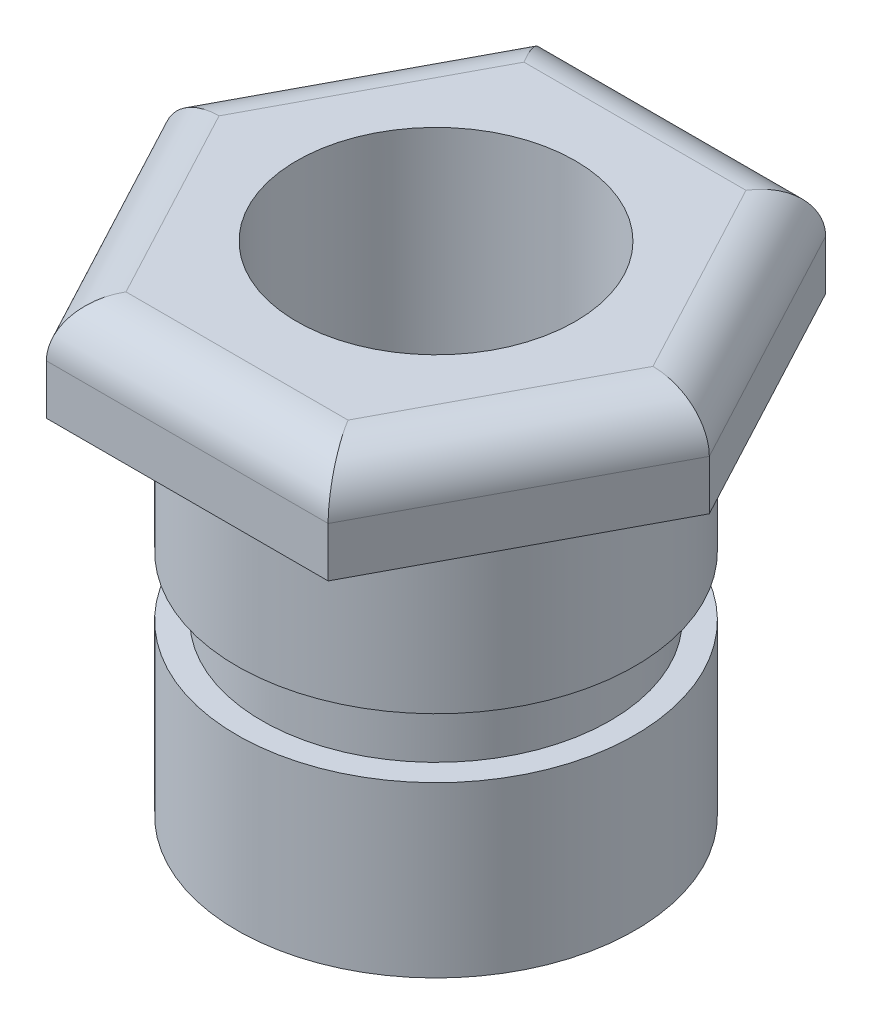
ISO-10303-21;
HEADER;
FILE_DESCRIPTION(('STEP AP214'),'2;1');
FILE_NAME('part.step','',(''),(''),'','','');
FILE_SCHEMA(('AUTOMOTIVE_DESIGN { 1 0 10303 214 1 1 1 1 }'));
ENDSEC;
DATA;
#1=APPLICATION_CONTEXT('core data for automotive mechanical design processes');
#2=APPLICATION_PROTOCOL_DEFINITION('international standard','automotive_design',2000,#1);
#3=PRODUCT_CONTEXT('',#1,'mechanical');
#4=PRODUCT('Part','Part','',(#3));
#5=PRODUCT_RELATED_PRODUCT_CATEGORY('part','',(#4));
#6=PRODUCT_DEFINITION_FORMATION('','',#4);
#7=PRODUCT_DEFINITION_CONTEXT('part definition',#1,'design');
#8=PRODUCT_DEFINITION('design','',#6,#7);
#9=PRODUCT_DEFINITION_SHAPE('','',#8);
#10=(LENGTH_UNIT() NAMED_UNIT(*) SI_UNIT(.MILLI.,.METRE.));
#11=(NAMED_UNIT(*) PLANE_ANGLE_UNIT() SI_UNIT($,.RADIAN.));
#12=(NAMED_UNIT(*) SI_UNIT($,.STERADIAN.) SOLID_ANGLE_UNIT());
#13=UNCERTAINTY_MEASURE_WITH_UNIT(LENGTH_MEASURE(1.E-05),#10,'distance_accuracy_value','');
#14=(GEOMETRIC_REPRESENTATION_CONTEXT(3) GLOBAL_UNCERTAINTY_ASSIGNED_CONTEXT((#13)) GLOBAL_UNIT_ASSIGNED_CONTEXT((#10,
#11,#12)) REPRESENTATION_CONTEXT('',''));
#15=CARTESIAN_POINT('',(0.,0.,0.));
#16=DIRECTION('',(0.,0.,1.));
#17=DIRECTION('',(1.,0.,0.));
#18=AXIS2_PLACEMENT_3D('',#15,#16,#17);
#19=CARTESIAN_POINT('',(0.,0.,0.));
#20=DIRECTION('',(0.,1.,0.));
#21=DIRECTION('',(-1.,0.,0.));
#22=AXIS2_PLACEMENT_3D('',#19,#20,#21);
#23=PLANE('',#22);
#24=CARTESIAN_POINT('',(0.,0.,0.));
#25=DIRECTION('',(0.,-1.,0.));
#26=DIRECTION('',(1.,0.,0.));
#27=AXIS2_PLACEMENT_3D('',#24,#25,#26);
#28=CIRCLE('',#27,28.);
#29=CARTESIAN_POINT('',(28.,0.,0.));
#30=VERTEX_POINT('',#29);
#31=EDGE_CURVE('E437',#30,#30,#28,.T.);
#32=ORIENTED_EDGE('',*,*,#31,.F.);
#33=EDGE_LOOP('',(#32));
#34=FACE_BOUND('',#33,.T.);
#35=CARTESIAN_POINT('',(0.,0.,0.));
#36=DIRECTION('',(0.,1.,0.));
#37=DIRECTION('',(-1.,0.,0.));
#38=AXIS2_PLACEMENT_3D('',#35,#36,#37);
#39=CIRCLE('',#38,40.);
#40=CARTESIAN_POINT('',(-40.,0.,0.));
#41=VERTEX_POINT('',#40);
#42=EDGE_CURVE('E163',#41,#41,#39,.T.);
#43=ORIENTED_EDGE('',*,*,#42,.F.);
#44=EDGE_LOOP('',(#43));
#45=FACE_BOUND('',#44,.T.);
#46=ADVANCED_FACE('F35',(#34,#45),#23,.F.);
#47=CARTESIAN_POINT('',(0.,103.412132622253,0.));
#48=DIRECTION('',(0.,1.,0.));
#49=DIRECTION('',(-1.,0.,0.));
#50=AXIS2_PLACEMENT_3D('',#47,#48,#49);
#51=CYLINDRICAL_SURFACE('',#50,40.);
#52=CARTESIAN_POINT('',(0.,34.,0.));
#53=DIRECTION('',(0.,1.,0.));
#54=DIRECTION('',(-1.,0.,0.));
#55=AXIS2_PLACEMENT_3D('',#52,#53,#54);
#56=CIRCLE('',#55,40.);
#57=CARTESIAN_POINT('',(-40.,34.,0.));
#58=VERTEX_POINT('',#57);
#59=EDGE_CURVE('E160',#58,#58,#56,.T.);
#60=ORIENTED_EDGE('',*,*,#59,.F.);
#61=EDGE_LOOP('',(#60));
#62=FACE_BOUND('',#61,.T.);
#63=ORIENTED_EDGE('',*,*,#42,.T.);
#64=EDGE_LOOP('',(#63));
#65=FACE_BOUND('',#64,.T.);
#66=ADVANCED_FACE('F241',(#62,#65),#51,.T.);
#67=CARTESIAN_POINT('',(40.,34.,0.));
#68=DIRECTION('',(0.,-1.,0.));
#69=DIRECTION('',(1.,0.,0.));
#70=AXIS2_PLACEMENT_3D('',#67,#68,#69);
#71=PLANE('',#70);
#72=CARTESIAN_POINT('',(0.,34.,0.));
#73=DIRECTION('',(0.,1.,0.));
#74=DIRECTION('',(-1.,0.,0.));
#75=AXIS2_PLACEMENT_3D('',#72,#73,#74);
#76=CIRCLE('',#75,35.);
#77=CARTESIAN_POINT('',(-35.,34.,0.));
#78=VERTEX_POINT('',#77);
#79=EDGE_CURVE('E157',#78,#78,#76,.T.);
#80=ORIENTED_EDGE('',*,*,#79,.F.);
#81=EDGE_LOOP('',(#80));
#82=FACE_BOUND('',#81,.T.);
#83=ORIENTED_EDGE('',*,*,#59,.T.);
#84=EDGE_LOOP('',(#83));
#85=FACE_BOUND('',#84,.T.);
#86=ADVANCED_FACE('F247',(#82,#85),#71,.F.);
#87=CARTESIAN_POINT('',(0.,103.412132622253,0.));
#88=DIRECTION('',(0.,1.,0.));
#89=DIRECTION('',(-1.,0.,0.));
#90=AXIS2_PLACEMENT_3D('',#87,#88,#89);
#91=CYLINDRICAL_SURFACE('',#90,35.);
#92=CARTESIAN_POINT('',(0.,46.,0.));
#93=DIRECTION('',(0.,1.,0.));
#94=DIRECTION('',(-1.,0.,0.));
#95=AXIS2_PLACEMENT_3D('',#92,#93,#94);
#96=CIRCLE('',#95,35.);
#97=CARTESIAN_POINT('',(-35.,46.,0.));
#98=VERTEX_POINT('',#97);
#99=EDGE_CURVE('E154',#98,#98,#96,.T.);
#100=ORIENTED_EDGE('',*,*,#99,.F.);
#101=EDGE_LOOP('',(#100));
#102=FACE_BOUND('',#101,.T.);
#103=ORIENTED_EDGE('',*,*,#79,.T.);
#104=EDGE_LOOP('',(#103));
#105=FACE_BOUND('',#104,.T.);
#106=ADVANCED_FACE('F312',(#102,#105),#91,.T.);
#107=CARTESIAN_POINT('',(35.,46.,0.));
#108=DIRECTION('',(0.,1.,0.));
#109=DIRECTION('',(-1.,0.,0.));
#110=AXIS2_PLACEMENT_3D('',#107,#108,#109);
#111=PLANE('',#110);
#112=CARTESIAN_POINT('',(0.,46.,0.));
#113=DIRECTION('',(0.,1.,0.));
#114=DIRECTION('',(-1.,0.,0.));
#115=AXIS2_PLACEMENT_3D('',#112,#113,#114);
#116=CIRCLE('',#115,40.);
#117=CARTESIAN_POINT('',(-40.,46.,0.));
#118=VERTEX_POINT('',#117);
#119=EDGE_CURVE('E151',#118,#118,#116,.T.);
#120=ORIENTED_EDGE('',*,*,#119,.F.);
#121=EDGE_LOOP('',(#120));
#122=FACE_BOUND('',#121,.T.);
#123=ORIENTED_EDGE('',*,*,#99,.T.);
#124=EDGE_LOOP('',(#123));
#125=FACE_BOUND('',#124,.T.);
#126=ADVANCED_FACE('F320',(#122,#125),#111,.F.);
#127=CARTESIAN_POINT('',(0.,103.412132622253,0.));
#128=DIRECTION('',(0.,1.,0.));
#129=DIRECTION('',(-1.,0.,0.));
#130=AXIS2_PLACEMENT_3D('',#127,#128,#129);
#131=CYLINDRICAL_SURFACE('',#130,40.);
#132=CARTESIAN_POINT('',(0.,80.,0.));
#133=DIRECTION('',(0.,1.,0.));
#134=DIRECTION('',(-1.,0.,0.));
#135=AXIS2_PLACEMENT_3D('',#132,#133,#134);
#136=CIRCLE('',#135,40.);
#137=CARTESIAN_POINT('',(-40.,80.,0.));
#138=VERTEX_POINT('',#137);
#139=EDGE_CURVE('E110',#138,#138,#136,.T.);
#140=ORIENTED_EDGE('',*,*,#139,.F.);
#141=EDGE_LOOP('',(#140));
#142=FACE_BOUND('',#141,.T.);
#143=ORIENTED_EDGE('',*,*,#119,.T.);
#144=EDGE_LOOP('',(#143));
#145=FACE_BOUND('',#144,.T.);
#146=ADVANCED_FACE('F329',(#142,#145),#131,.T.);
#147=CARTESIAN_POINT('',(-54.9387410932508,100.,0.));
#148=DIRECTION('',(0.882716252249093,0.,0.469906392822353));
#149=DIRECTION('',(0.469906392822353,0.,-0.882716252249093));
#150=AXIS2_PLACEMENT_3D('',#147,#148,#149);
#151=PLANE('',#150);
#152=DIRECTION('',(0.,-1.,0.));
#153=VECTOR('',#152,1.);
#154=CARTESIAN_POINT('',(-54.9387410932508,100.,0.));
#155=LINE('',#154,#153);
#156=CARTESIAN_POINT('',(-54.9387410932508,90.,0.));
#157=VERTEX_POINT('',#156);
#158=CARTESIAN_POINT('',(-54.9387410932508,80.,0.));
#159=VERTEX_POINT('',#158);
#160=EDGE_CURVE('E104',#157,#159,#155,.T.);
#161=ORIENTED_EDGE('',*,*,#160,.F.);
#162=DIRECTION('',(-0.469906392822353,0.,0.882716252249093));
#163=VECTOR('',#162,1.);
#164=CARTESIAN_POINT('',(-54.9387410932508,90.,0.));
#165=LINE('',#164,#163);
#166=CARTESIAN_POINT('',(-28.3216718127732,90.,-50.));
#167=VERTEX_POINT('',#166);
#168=EDGE_CURVE('E44',#157,#167,#165,.F.);
#169=ORIENTED_EDGE('',*,*,#168,.T.);
#170=DIRECTION('',(0.,-1.,0.));
#171=VECTOR('',#170,1.);
#172=CARTESIAN_POINT('',(-28.3216718127732,100.,-50.));
#173=LINE('',#172,#171);
#174=CARTESIAN_POINT('',(-28.3216718127732,80.,-50.));
#175=VERTEX_POINT('',#174);
#176=EDGE_CURVE('E123',#167,#175,#173,.T.);
#177=ORIENTED_EDGE('',*,*,#176,.T.);
#178=DIRECTION('',(-0.469906392822353,0.,0.882716252249093));
#179=VECTOR('',#178,1.);
#180=CARTESIAN_POINT('',(-54.9387410932508,80.,0.));
#181=LINE('',#180,#179);
#182=EDGE_CURVE('E117',#175,#159,#181,.T.);
#183=ORIENTED_EDGE('',*,*,#182,.T.);
#184=EDGE_LOOP('',(#161,#169,#177,#183));
#185=FACE_BOUND('',#184,.T.);
#186=ADVANCED_FACE('F122',(#185),#151,.F.);
#187=CARTESIAN_POINT('',(-28.3216718127733,100.,50.));
#188=DIRECTION('',(0.882716252249093,0.,-0.469906392822353));
#189=DIRECTION('',(-0.469906392822353,0.,-0.882716252249093));
#190=AXIS2_PLACEMENT_3D('',#187,#188,#189);
#191=PLANE('',#190);
#192=DIRECTION('',(0.,-1.,0.));
#193=VECTOR('',#192,1.);
#194=CARTESIAN_POINT('',(-28.3216718127733,100.,50.));
#195=LINE('',#194,#193);
#196=CARTESIAN_POINT('',(-28.3216718127733,90.,50.));
#197=VERTEX_POINT('',#196);
#198=CARTESIAN_POINT('',(-28.3216718127733,80.,50.));
#199=VERTEX_POINT('',#198);
#200=EDGE_CURVE('E111',#197,#199,#195,.T.);
#201=ORIENTED_EDGE('',*,*,#200,.F.);
#202=DIRECTION('',(0.469906392822353,0.,0.882716252249093));
#203=VECTOR('',#202,1.);
#204=CARTESIAN_POINT('',(-28.3216718127733,90.,50.));
#205=LINE('',#204,#203);
#206=EDGE_CURVE('E11',#197,#157,#205,.F.);
#207=ORIENTED_EDGE('',*,*,#206,.T.);
#208=ORIENTED_EDGE('',*,*,#160,.T.);
#209=DIRECTION('',(0.469906392822353,0.,0.882716252249093));
#210=VECTOR('',#209,1.);
#211=CARTESIAN_POINT('',(-28.3216718127733,80.,50.));
#212=LINE('',#211,#210);
#213=EDGE_CURVE('E107',#159,#199,#212,.T.);
#214=ORIENTED_EDGE('',*,*,#213,.T.);
#215=EDGE_LOOP('',(#201,#207,#208,#214));
#216=FACE_BOUND('',#215,.T.);
#217=ADVANCED_FACE('F106',(#216),#191,.F.);
#218=CARTESIAN_POINT('',(28.3216718127733,100.,50.));
#219=DIRECTION('',(0.,0.,-1.));
#220=DIRECTION('',(-1.,0.,0.));
#221=AXIS2_PLACEMENT_3D('',#218,#219,#220);
#222=PLANE('',#221);
#223=DIRECTION('',(0.,-1.,0.));
#224=VECTOR('',#223,1.);
#225=CARTESIAN_POINT('',(28.3216718127733,100.,50.));
#226=LINE('',#225,#224);
#227=CARTESIAN_POINT('',(28.3216718127733,90.,50.));
#228=VERTEX_POINT('',#227);
#229=CARTESIAN_POINT('',(28.3216718127733,80.,50.));
#230=VERTEX_POINT('',#229);
#231=EDGE_CURVE('E146',#228,#230,#226,.T.);
#232=ORIENTED_EDGE('',*,*,#231,.F.);
#233=DIRECTION('',(1.,0.,0.));
#234=VECTOR('',#233,1.);
#235=CARTESIAN_POINT('',(28.3216718127733,90.,50.));
#236=LINE('',#235,#234);
#237=EDGE_CURVE('E179',#228,#197,#236,.F.);
#238=ORIENTED_EDGE('',*,*,#237,.T.);
#239=ORIENTED_EDGE('',*,*,#200,.T.);
#240=DIRECTION('',(1.,0.,0.));
#241=VECTOR('',#240,1.);
#242=CARTESIAN_POINT('',(28.3216718127733,80.,50.));
#243=LINE('',#242,#241);
#244=EDGE_CURVE('E120',#199,#230,#243,.T.);
#245=ORIENTED_EDGE('',*,*,#244,.T.);
#246=EDGE_LOOP('',(#232,#238,#239,#245));
#247=FACE_BOUND('',#246,.T.);
#248=ADVANCED_FACE('F225',(#247),#222,.F.);
#249=CARTESIAN_POINT('',(54.9387410932509,100.,0.));
#250=DIRECTION('',(-0.882716252249093,0.,-0.469906392822353));
#251=DIRECTION('',(-0.469906392822353,0.,0.882716252249093));
#252=AXIS2_PLACEMENT_3D('',#249,#250,#251);
#253=PLANE('',#252);
#254=DIRECTION('',(0.,-1.,0.));
#255=VECTOR('',#254,1.);
#256=CARTESIAN_POINT('',(54.9387410932509,100.,0.));
#257=LINE('',#256,#255);
#258=CARTESIAN_POINT('',(54.9387410932509,90.,0.));
#259=VERTEX_POINT('',#258);
#260=CARTESIAN_POINT('',(54.9387410932509,80.,0.));
#261=VERTEX_POINT('',#260);
#262=EDGE_CURVE('E144',#259,#261,#257,.T.);
#263=ORIENTED_EDGE('',*,*,#262,.F.);
#264=DIRECTION('',(0.469906392822353,0.,-0.882716252249093));
#265=VECTOR('',#264,1.);
#266=CARTESIAN_POINT('',(54.9387410932509,90.,0.));
#267=LINE('',#266,#265);
#268=EDGE_CURVE('E182',#259,#228,#267,.F.);
#269=ORIENTED_EDGE('',*,*,#268,.T.);
#270=ORIENTED_EDGE('',*,*,#231,.T.);
#271=DIRECTION('',(0.469906392822353,0.,-0.882716252249093));
#272=VECTOR('',#271,1.);
#273=CARTESIAN_POINT('',(54.9387410932509,80.,0.));
#274=LINE('',#273,#272);
#275=EDGE_CURVE('E133',#230,#261,#274,.T.);
#276=ORIENTED_EDGE('',*,*,#275,.T.);
#277=EDGE_LOOP('',(#263,#269,#270,#276));
#278=FACE_BOUND('',#277,.T.);
#279=ADVANCED_FACE('F222',(#278),#253,.F.);
#280=CARTESIAN_POINT('',(28.3216718127733,100.,-50.));
#281=DIRECTION('',(-0.882716252249093,0.,0.469906392822353));
#282=DIRECTION('',(0.469906392822353,0.,0.882716252249093));
#283=AXIS2_PLACEMENT_3D('',#280,#281,#282);
#284=PLANE('',#283);
#285=DIRECTION('',(0.,-1.,0.));
#286=VECTOR('',#285,1.);
#287=CARTESIAN_POINT('',(28.3216718127733,100.,-50.));
#288=LINE('',#287,#286);
#289=CARTESIAN_POINT('',(28.3216718127733,90.,-50.));
#290=VERTEX_POINT('',#289);
#291=CARTESIAN_POINT('',(28.3216718127733,80.,-50.));
#292=VERTEX_POINT('',#291);
#293=EDGE_CURVE('E142',#290,#292,#288,.T.);
#294=ORIENTED_EDGE('',*,*,#293,.F.);
#295=DIRECTION('',(-0.469906392822353,0.,-0.882716252249093));
#296=VECTOR('',#295,1.);
#297=CARTESIAN_POINT('',(28.3216718127733,90.,-50.));
#298=LINE('',#297,#296);
#299=EDGE_CURVE('E184',#290,#259,#298,.F.);
#300=ORIENTED_EDGE('',*,*,#299,.T.);
#301=ORIENTED_EDGE('',*,*,#262,.T.);
#302=DIRECTION('',(-0.469906392822353,0.,-0.882716252249093));
#303=VECTOR('',#302,1.);
#304=CARTESIAN_POINT('',(28.3216718127733,80.,-50.));
#305=LINE('',#304,#303);
#306=EDGE_CURVE('E136',#261,#292,#305,.T.);
#307=ORIENTED_EDGE('',*,*,#306,.T.);
#308=EDGE_LOOP('',(#294,#300,#301,#307));
#309=FACE_BOUND('',#308,.T.);
#310=ADVANCED_FACE('F368',(#309),#284,.F.);
#311=CARTESIAN_POINT('',(-28.3216718127732,100.,-50.));
#312=DIRECTION('',(0.,0.,1.));
#313=DIRECTION('',(1.,0.,0.));
#314=AXIS2_PLACEMENT_3D('',#311,#312,#313);
#315=PLANE('',#314);
#316=ORIENTED_EDGE('',*,*,#176,.F.);
#317=DIRECTION('',(-1.,0.,0.));
#318=VECTOR('',#317,1.);
#319=CARTESIAN_POINT('',(-28.3216718127732,90.,-50.));
#320=LINE('',#319,#318);
#321=EDGE_CURVE('E186',#167,#290,#320,.F.);
#322=ORIENTED_EDGE('',*,*,#321,.T.);
#323=ORIENTED_EDGE('',*,*,#293,.T.);
#324=DIRECTION('',(-1.,0.,0.));
#325=VECTOR('',#324,1.);
#326=CARTESIAN_POINT('',(-28.3216718127732,80.,-50.));
#327=LINE('',#326,#325);
#328=EDGE_CURVE('E139',#292,#175,#327,.T.);
#329=ORIENTED_EDGE('',*,*,#328,.T.);
#330=EDGE_LOOP('',(#316,#322,#323,#329));
#331=FACE_BOUND('',#330,.T.);
#332=ADVANCED_FACE('F287',(#331),#315,.F.);
#333=CARTESIAN_POINT('',(0.,100.,0.));
#334=DIRECTION('',(0.,-1.,0.));
#335=DIRECTION('',(0.,0.,-1.));
#336=AXIS2_PLACEMENT_3D('',#333,#334,#335);
#337=PLANE('',#336);
#338=CARTESIAN_POINT('',(0.,100.,0.));
#339=DIRECTION('',(0.,-1.,0.));
#340=DIRECTION('',(0.,0.,-1.));
#341=AXIS2_PLACEMENT_3D('',#338,#339,#340);
#342=CIRCLE('',#341,28.);
#343=CARTESIAN_POINT('',(0.,100.,-28.));
#344=VERTEX_POINT('',#343);
#345=EDGE_CURVE('E129',#344,#344,#342,.F.);
#346=ORIENTED_EDGE('',*,*,#345,.F.);
#347=EDGE_LOOP('',(#346));
#348=FACE_BOUND('',#347,.T.);
#349=DIRECTION('',(0.469906392822353,0.,0.882716252249093));
#350=VECTOR('',#349,1.);
#351=CARTESIAN_POINT('',(-33.9804442827383,100.,18.0891967931011));
#352=LINE('',#351,#350);
#353=CARTESIAN_POINT('',(-43.6100723681416,100.,0.));
#354=VERTEX_POINT('',#353);
#355=CARTESIAN_POINT('',(-22.3164169437595,100.,40.));
#356=VERTEX_POINT('',#355);
#357=EDGE_CURVE('E166',#354,#356,#352,.T.);
#358=ORIENTED_EDGE('',*,*,#357,.T.);
#359=DIRECTION('',(1.,0.,0.));
#360=VECTOR('',#359,1.);
#361=CARTESIAN_POINT('',(0.,100.,40.));
#362=LINE('',#361,#360);
#363=CARTESIAN_POINT('',(22.3164169437595,100.,40.));
#364=VERTEX_POINT('',#363);
#365=EDGE_CURVE('E176',#356,#364,#362,.T.);
#366=ORIENTED_EDGE('',*,*,#365,.T.);
#367=DIRECTION('',(0.469906392822353,0.,-0.882716252249093));
#368=VECTOR('',#367,1.);
#369=CARTESIAN_POINT('',(33.9804442827383,100.,18.0891967931011));
#370=LINE('',#369,#368);
#371=CARTESIAN_POINT('',(43.6100723681416,100.,0.));
#372=VERTEX_POINT('',#371);
#373=EDGE_CURVE('E174',#364,#372,#370,.T.);
#374=ORIENTED_EDGE('',*,*,#373,.T.);
#375=DIRECTION('',(-0.469906392822353,0.,-0.882716252249093));
#376=VECTOR('',#375,1.);
#377=CARTESIAN_POINT('',(33.9804442827383,100.,-18.0891967931011));
#378=LINE('',#377,#376);
#379=CARTESIAN_POINT('',(22.3164169437595,100.,-40.));
#380=VERTEX_POINT('',#379);
#381=EDGE_CURVE('E172',#372,#380,#378,.T.);
#382=ORIENTED_EDGE('',*,*,#381,.T.);
#383=DIRECTION('',(-1.,0.,0.));
#384=VECTOR('',#383,1.);
#385=CARTESIAN_POINT('',(0.,100.,-40.));
#386=LINE('',#385,#384);
#387=CARTESIAN_POINT('',(-22.3164169437595,100.,-40.));
#388=VERTEX_POINT('',#387);
#389=EDGE_CURVE('E170',#380,#388,#386,.T.);
#390=ORIENTED_EDGE('',*,*,#389,.T.);
#391=DIRECTION('',(-0.469906392822353,0.,0.882716252249093));
#392=VECTOR('',#391,1.);
#393=CARTESIAN_POINT('',(-33.9804442827382,100.,-18.0891967931011));
#394=LINE('',#393,#392);
#395=EDGE_CURVE('E168',#388,#354,#394,.T.);
#396=ORIENTED_EDGE('',*,*,#395,.T.);
#397=EDGE_LOOP('',(#358,#366,#374,#382,#390,#396));
#398=FACE_BOUND('',#397,.T.);
#399=ADVANCED_FACE('F211',(#348,#398),#337,.F.);
#400=CARTESIAN_POINT('',(0.,80.,0.));
#401=DIRECTION('',(0.,-1.,0.));
#402=DIRECTION('',(0.,0.,-1.));
#403=AXIS2_PLACEMENT_3D('',#400,#401,#402);
#404=PLANE('',#403);
#405=ORIENTED_EDGE('',*,*,#139,.T.);
#406=EDGE_LOOP('',(#405));
#407=FACE_BOUND('',#406,.T.);
#408=ORIENTED_EDGE('',*,*,#182,.F.);
#409=ORIENTED_EDGE('',*,*,#328,.F.);
#410=ORIENTED_EDGE('',*,*,#306,.F.);
#411=ORIENTED_EDGE('',*,*,#275,.F.);
#412=ORIENTED_EDGE('',*,*,#244,.F.);
#413=ORIENTED_EDGE('',*,*,#213,.F.);
#414=EDGE_LOOP('',(#408,#409,#410,#411,#412,#413));
#415=FACE_BOUND('',#414,.T.);
#416=ADVANCED_FACE('F115',(#407,#415),#404,.T.);
#417=CARTESIAN_POINT('',(0.,90.,-40.));
#418=DIRECTION('',(-1.,0.,0.));
#419=DIRECTION('',(0.,0.,1.));
#420=AXIS2_PLACEMENT_3D('',#417,#418,#419);
#421=CYLINDRICAL_SURFACE('',#420,10.);
#422=CARTESIAN_POINT('',(22.3164169437595,90.,-40.));
#423=DIRECTION('',(-0.85729411313223,0.,-0.514826964706418));
#424=DIRECTION('',(-0.514826964706418,0.,0.85729411313223));
#425=AXIS2_PLACEMENT_3D('',#422,#423,#424);
#426=ELLIPSE('',#425,11.6646082678251,10.);
#427=EDGE_CURVE('E127',#290,#380,#426,.F.);
#428=ORIENTED_EDGE('',*,*,#427,.F.);
#429=ORIENTED_EDGE('',*,*,#321,.F.);
#430=CARTESIAN_POINT('',(-22.3164169437594,90.,-40.));
#431=DIRECTION('',(-0.85729411313223,0.,0.514826964706418));
#432=DIRECTION('',(0.514826964706418,0.,0.85729411313223));
#433=AXIS2_PLACEMENT_3D('',#430,#431,#432);
#434=ELLIPSE('',#433,11.6646082678251,10.);
#435=EDGE_CURVE('E39',#388,#167,#434,.T.);
#436=ORIENTED_EDGE('',*,*,#435,.F.);
#437=ORIENTED_EDGE('',*,*,#389,.F.);
#438=EDGE_LOOP('',(#428,#429,#436,#437));
#439=FACE_BOUND('',#438,.T.);
#440=ADVANCED_FACE('F37',(#439),#421,.T.);
#441=CARTESIAN_POINT('',(-33.9804442827382,90.,-18.0891967931011));
#442=DIRECTION('',(-0.469906392822353,0.,0.882716252249093));
#443=DIRECTION('',(0.882716252249093,0.,0.469906392822353));
#444=AXIS2_PLACEMENT_3D('',#441,#442,#443);
#445=CYLINDRICAL_SURFACE('',#444,10.);
#446=ORIENTED_EDGE('',*,*,#435,.T.);
#447=ORIENTED_EDGE('',*,*,#168,.F.);
#448=CARTESIAN_POINT('',(-43.6100723681415,90.,0.));
#449=DIRECTION('',(0.,0.,1.));
#450=DIRECTION('',(1.,0.,0.));
#451=AXIS2_PLACEMENT_3D('',#448,#449,#450);
#452=ELLIPSE('',#451,11.3286687251093,10.);
#453=EDGE_CURVE('E196',#354,#157,#452,.T.);
#454=ORIENTED_EDGE('',*,*,#453,.F.);
#455=ORIENTED_EDGE('',*,*,#395,.F.);
#456=EDGE_LOOP('',(#446,#447,#454,#455));
#457=FACE_BOUND('',#456,.T.);
#458=ADVANCED_FACE('F233',(#457),#445,.T.);
#459=CARTESIAN_POINT('',(33.9804442827383,90.,-18.0891967931011));
#460=DIRECTION('',(-0.469906392822353,0.,-0.882716252249093));
#461=DIRECTION('',(-0.882716252249093,0.,0.469906392822353));
#462=AXIS2_PLACEMENT_3D('',#459,#460,#461);
#463=CYLINDRICAL_SURFACE('',#462,10.);
#464=ORIENTED_EDGE('',*,*,#427,.T.);
#465=ORIENTED_EDGE('',*,*,#381,.F.);
#466=CARTESIAN_POINT('',(43.6100723681416,90.,0.));
#467=DIRECTION('',(0.,0.,-1.));
#468=DIRECTION('',(-1.,0.,0.));
#469=AXIS2_PLACEMENT_3D('',#466,#467,#468);
#470=ELLIPSE('',#469,11.3286687251093,10.);
#471=EDGE_CURVE('E193',#259,#372,#470,.F.);
#472=ORIENTED_EDGE('',*,*,#471,.F.);
#473=ORIENTED_EDGE('',*,*,#299,.F.);
#474=EDGE_LOOP('',(#464,#465,#472,#473));
#475=FACE_BOUND('',#474,.T.);
#476=ADVANCED_FACE('F203',(#475),#463,.T.);
#477=CARTESIAN_POINT('',(-33.9804442827383,90.,18.0891967931011));
#478=DIRECTION('',(0.469906392822353,0.,0.882716252249093));
#479=DIRECTION('',(0.882716252249093,0.,-0.469906392822353));
#480=AXIS2_PLACEMENT_3D('',#477,#478,#479);
#481=CYLINDRICAL_SURFACE('',#480,10.);
#482=ORIENTED_EDGE('',*,*,#453,.T.);
#483=ORIENTED_EDGE('',*,*,#206,.F.);
#484=CARTESIAN_POINT('',(-22.3164169437595,90.,40.));
#485=DIRECTION('',(0.85729411313223,0.,0.514826964706418));
#486=DIRECTION('',(-0.514826964706418,0.,0.85729411313223));
#487=AXIS2_PLACEMENT_3D('',#484,#485,#486);
#488=ELLIPSE('',#487,11.6646082678251,10.);
#489=EDGE_CURVE('E191',#356,#197,#488,.T.);
#490=ORIENTED_EDGE('',*,*,#489,.F.);
#491=ORIENTED_EDGE('',*,*,#357,.F.);
#492=EDGE_LOOP('',(#482,#483,#490,#491));
#493=FACE_BOUND('',#492,.T.);
#494=ADVANCED_FACE('F231',(#493),#481,.T.);
#495=CARTESIAN_POINT('',(33.9804442827383,90.,18.0891967931011));
#496=DIRECTION('',(0.469906392822353,0.,-0.882716252249093));
#497=DIRECTION('',(-0.882716252249093,0.,-0.469906392822353));
#498=AXIS2_PLACEMENT_3D('',#495,#496,#497);
#499=CYLINDRICAL_SURFACE('',#498,10.);
#500=ORIENTED_EDGE('',*,*,#471,.T.);
#501=ORIENTED_EDGE('',*,*,#373,.F.);
#502=CARTESIAN_POINT('',(22.3164169437595,90.,40.));
#503=DIRECTION('',(0.85729411313223,0.,-0.514826964706418));
#504=DIRECTION('',(-0.514826964706418,0.,-0.85729411313223));
#505=AXIS2_PLACEMENT_3D('',#502,#503,#504);
#506=ELLIPSE('',#505,11.6646082678251,10.);
#507=EDGE_CURVE('E189',#228,#364,#506,.F.);
#508=ORIENTED_EDGE('',*,*,#507,.F.);
#509=ORIENTED_EDGE('',*,*,#268,.F.);
#510=EDGE_LOOP('',(#500,#501,#508,#509));
#511=FACE_BOUND('',#510,.T.);
#512=ADVANCED_FACE('F217',(#511),#499,.T.);
#513=CARTESIAN_POINT('',(0.,90.,40.));
#514=DIRECTION('',(1.,0.,0.));
#515=DIRECTION('',(0.,0.,-1.));
#516=AXIS2_PLACEMENT_3D('',#513,#514,#515);
#517=CYLINDRICAL_SURFACE('',#516,10.);
#518=ORIENTED_EDGE('',*,*,#489,.T.);
#519=ORIENTED_EDGE('',*,*,#237,.F.);
#520=ORIENTED_EDGE('',*,*,#507,.T.);
#521=ORIENTED_EDGE('',*,*,#365,.F.);
#522=EDGE_LOOP('',(#518,#519,#520,#521));
#523=FACE_BOUND('',#522,.T.);
#524=ADVANCED_FACE('F227',(#523),#517,.T.);
#525=CARTESIAN_POINT('',(0.,100.001,0.));
#526=DIRECTION('',(0.,-1.,0.));
#527=DIRECTION('',(1.,0.,0.));
#528=AXIS2_PLACEMENT_3D('',#525,#526,#527);
#529=CYLINDRICAL_SURFACE('',#528,28.);
#530=ORIENTED_EDGE('',*,*,#31,.T.);
#531=EDGE_LOOP('',(#530));
#532=FACE_BOUND('',#531,.T.);
#533=ORIENTED_EDGE('',*,*,#345,.T.);
#534=EDGE_LOOP('',(#533));
#535=FACE_BOUND('',#534,.T.);
#536=ADVANCED_FACE('F256',(#532,#535),#529,.F.);
#537=CLOSED_SHELL('',(#46,#66,#86,#106,#126,#146,#186,#217,#248,#279,#310,#332,#399,#416,#440,
#458,#476,#494,#512,#524,#536));
#538=MANIFOLD_SOLID_BREP('B2',#537);
#539=ADVANCED_BREP_SHAPE_REPRESENTATION('',(#18,#538),#14);
#540=SHAPE_DEFINITION_REPRESENTATION(#9,#539);
ENDSEC;
END-ISO-10303-21;
